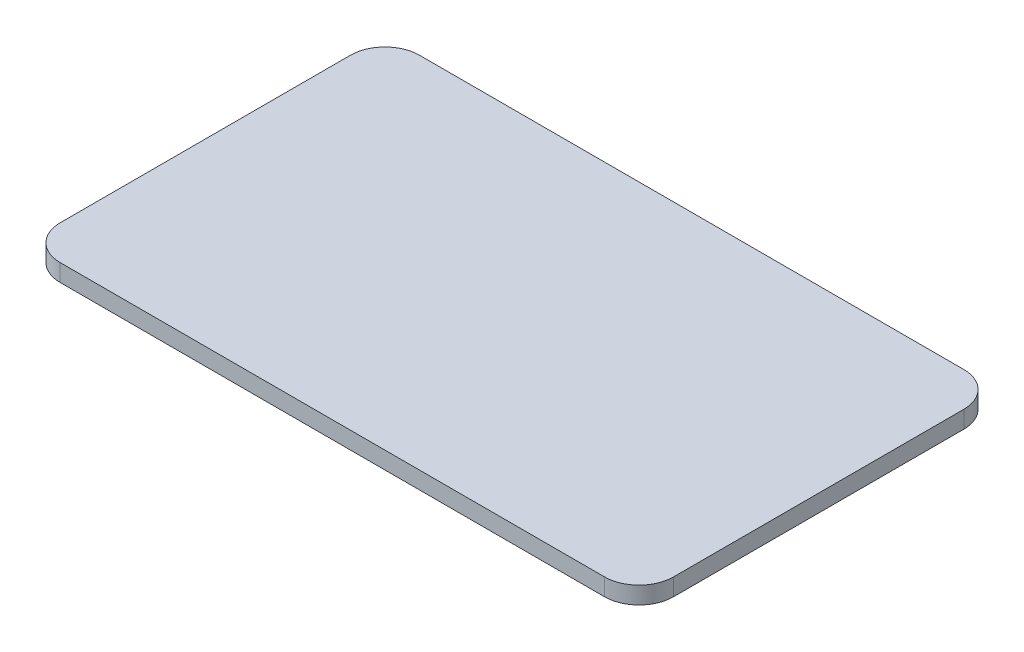
ISO-10303-21;
HEADER;
FILE_DESCRIPTION(('STEP AP214'),'2;1');
FILE_NAME('part.step','',(''),(''),'','','');
FILE_SCHEMA(('AUTOMOTIVE_DESIGN { 1 0 10303 214 1 1 1 1 }'));
ENDSEC;
DATA;
#1=APPLICATION_CONTEXT('core data for automotive mechanical design processes');
#2=APPLICATION_PROTOCOL_DEFINITION('international standard','automotive_design',2000,#1);
#3=PRODUCT_CONTEXT('',#1,'mechanical');
#4=PRODUCT('Part','Part','',(#3));
#5=PRODUCT_RELATED_PRODUCT_CATEGORY('part','',(#4));
#6=PRODUCT_DEFINITION_FORMATION('','',#4);
#7=PRODUCT_DEFINITION_CONTEXT('part definition',#1,'design');
#8=PRODUCT_DEFINITION('design','',#6,#7);
#9=PRODUCT_DEFINITION_SHAPE('','',#8);
#10=(LENGTH_UNIT() NAMED_UNIT(*) SI_UNIT(.MILLI.,.METRE.));
#11=(NAMED_UNIT(*) PLANE_ANGLE_UNIT() SI_UNIT($,.RADIAN.));
#12=(NAMED_UNIT(*) SI_UNIT($,.STERADIAN.) SOLID_ANGLE_UNIT());
#13=UNCERTAINTY_MEASURE_WITH_UNIT(LENGTH_MEASURE(1.E-05),#10,'distance_accuracy_value','');
#14=(GEOMETRIC_REPRESENTATION_CONTEXT(3) GLOBAL_UNCERTAINTY_ASSIGNED_CONTEXT((#13)) GLOBAL_UNIT_ASSIGNED_CONTEXT((#10,
#11,#12)) REPRESENTATION_CONTEXT('',''));
#15=CARTESIAN_POINT('',(0.,0.,0.));
#16=DIRECTION('',(0.,0.,1.));
#17=DIRECTION('',(1.,0.,0.));
#18=AXIS2_PLACEMENT_3D('',#15,#16,#17);
#19=CARTESIAN_POINT('',(39.45,2.5,21.035));
#20=DIRECTION('',(0.,-1.,0.));
#21=DIRECTION('',(0.,0.,-1.));
#22=AXIS2_PLACEMENT_3D('',#19,#20,#21);
#23=CYLINDRICAL_SURFACE('',#22,5.);
#24=CARTESIAN_POINT('',(39.45,0.,21.035));
#25=DIRECTION('',(0.,1.,0.));
#26=DIRECTION('',(0.,0.,1.));
#27=AXIS2_PLACEMENT_3D('',#24,#25,#26);
#28=CIRCLE('',#27,5.);
#29=CARTESIAN_POINT('',(39.45,0.,26.035));
#30=VERTEX_POINT('',#29);
#31=CARTESIAN_POINT('',(44.45,0.,21.035));
#32=VERTEX_POINT('',#31);
#33=EDGE_CURVE('E136',#30,#32,#28,.T.);
#34=ORIENTED_EDGE('',*,*,#33,.T.);
#35=DIRECTION('',(0.,-1.,0.));
#36=VECTOR('',#35,1.);
#37=CARTESIAN_POINT('',(44.45,2.5,21.035));
#38=LINE('',#37,#36);
#39=CARTESIAN_POINT('',(44.45,2.5,21.035));
#40=VERTEX_POINT('',#39);
#41=EDGE_CURVE('E11',#40,#32,#38,.T.);
#42=ORIENTED_EDGE('',*,*,#41,.F.);
#43=CARTESIAN_POINT('',(39.45,2.5,21.035));
#44=DIRECTION('',(0.,1.,0.));
#45=DIRECTION('',(0.,0.,1.));
#46=AXIS2_PLACEMENT_3D('',#43,#44,#45);
#47=CIRCLE('',#46,5.);
#48=CARTESIAN_POINT('',(39.45,2.5,26.035));
#49=VERTEX_POINT('',#48);
#50=EDGE_CURVE('E150',#49,#40,#47,.T.);
#51=ORIENTED_EDGE('',*,*,#50,.F.);
#52=DIRECTION('',(0.,-1.,0.));
#53=VECTOR('',#52,1.);
#54=CARTESIAN_POINT('',(39.45,2.5,26.035));
#55=LINE('',#54,#53);
#56=EDGE_CURVE('E132',#49,#30,#55,.T.);
#57=ORIENTED_EDGE('',*,*,#56,.T.);
#58=EDGE_LOOP('',(#34,#42,#51,#57));
#59=FACE_BOUND('',#58,.T.);
#60=ADVANCED_FACE('F40',(#59),#23,.T.);
#61=CARTESIAN_POINT('',(44.45,2.5,21.035));
#62=DIRECTION('',(-1.,0.,0.));
#63=DIRECTION('',(0.,0.,1.));
#64=AXIS2_PLACEMENT_3D('',#61,#62,#63);
#65=PLANE('',#64);
#66=DIRECTION('',(0.,0.,-1.));
#67=VECTOR('',#66,1.);
#68=CARTESIAN_POINT('',(44.45,0.,21.035));
#69=LINE('',#68,#67);
#70=CARTESIAN_POINT('',(44.45,0.,-21.035));
#71=VERTEX_POINT('',#70);
#72=EDGE_CURVE('E139',#32,#71,#69,.T.);
#73=ORIENTED_EDGE('',*,*,#72,.T.);
#74=DIRECTION('',(0.,-1.,0.));
#75=VECTOR('',#74,1.);
#76=CARTESIAN_POINT('',(44.45,2.5,-21.035));
#77=LINE('',#76,#75);
#78=CARTESIAN_POINT('',(44.45,2.5,-21.035));
#79=VERTEX_POINT('',#78);
#80=EDGE_CURVE('E48',#79,#71,#77,.T.);
#81=ORIENTED_EDGE('',*,*,#80,.F.);
#82=DIRECTION('',(0.,0.,-1.));
#83=VECTOR('',#82,1.);
#84=CARTESIAN_POINT('',(44.45,2.5,21.035));
#85=LINE('',#84,#83);
#86=EDGE_CURVE('E99',#40,#79,#85,.T.);
#87=ORIENTED_EDGE('',*,*,#86,.F.);
#88=ORIENTED_EDGE('',*,*,#41,.T.);
#89=EDGE_LOOP('',(#73,#81,#87,#88));
#90=FACE_BOUND('',#89,.T.);
#91=ADVANCED_FACE('F185',(#90),#65,.F.);
#92=CARTESIAN_POINT('',(39.45,2.5,-21.035));
#93=DIRECTION('',(0.,-1.,0.));
#94=DIRECTION('',(0.,0.,-1.));
#95=AXIS2_PLACEMENT_3D('',#92,#93,#94);
#96=CYLINDRICAL_SURFACE('',#95,5.);
#97=CARTESIAN_POINT('',(39.45,0.,-21.035));
#98=DIRECTION('',(0.,1.,0.));
#99=DIRECTION('',(0.,0.,-1.));
#100=AXIS2_PLACEMENT_3D('',#97,#98,#99);
#101=CIRCLE('',#100,5.);
#102=CARTESIAN_POINT('',(39.45,0.,-26.035));
#103=VERTEX_POINT('',#102);
#104=EDGE_CURVE('E141',#71,#103,#101,.T.);
#105=ORIENTED_EDGE('',*,*,#104,.T.);
#106=DIRECTION('',(0.,-1.,0.));
#107=VECTOR('',#106,1.);
#108=CARTESIAN_POINT('',(39.45,2.5,-26.035));
#109=LINE('',#108,#107);
#110=CARTESIAN_POINT('',(39.45,2.5,-26.035));
#111=VERTEX_POINT('',#110);
#112=EDGE_CURVE('E157',#111,#103,#109,.T.);
#113=ORIENTED_EDGE('',*,*,#112,.F.);
#114=CARTESIAN_POINT('',(39.45,2.5,-21.035));
#115=DIRECTION('',(0.,1.,0.));
#116=DIRECTION('',(0.,0.,-1.));
#117=AXIS2_PLACEMENT_3D('',#114,#115,#116);
#118=CIRCLE('',#117,5.);
#119=EDGE_CURVE('E165',#79,#111,#118,.T.);
#120=ORIENTED_EDGE('',*,*,#119,.F.);
#121=ORIENTED_EDGE('',*,*,#80,.T.);
#122=EDGE_LOOP('',(#105,#113,#120,#121));
#123=FACE_BOUND('',#122,.T.);
#124=ADVANCED_FACE('F163',(#123),#96,.T.);
#125=CARTESIAN_POINT('',(-39.45,2.5,-26.035));
#126=DIRECTION('',(0.,0.,1.));
#127=DIRECTION('',(1.,0.,0.));
#128=AXIS2_PLACEMENT_3D('',#125,#126,#127);
#129=PLANE('',#128);
#130=DIRECTION('',(-1.,0.,0.));
#131=VECTOR('',#130,1.);
#132=CARTESIAN_POINT('',(-39.45,0.,-26.035));
#133=LINE('',#132,#131);
#134=CARTESIAN_POINT('',(-39.45,0.,-26.035));
#135=VERTEX_POINT('',#134);
#136=EDGE_CURVE('E143',#103,#135,#133,.T.);
#137=ORIENTED_EDGE('',*,*,#136,.T.);
#138=DIRECTION('',(0.,-1.,0.));
#139=VECTOR('',#138,1.);
#140=CARTESIAN_POINT('',(-39.45,2.5,-26.035));
#141=LINE('',#140,#139);
#142=CARTESIAN_POINT('',(-39.45,2.5,-26.035));
#143=VERTEX_POINT('',#142);
#144=EDGE_CURVE('E154',#143,#135,#141,.T.);
#145=ORIENTED_EDGE('',*,*,#144,.F.);
#146=DIRECTION('',(-1.,0.,0.));
#147=VECTOR('',#146,1.);
#148=CARTESIAN_POINT('',(-39.45,2.5,-26.035));
#149=LINE('',#148,#147);
#150=EDGE_CURVE('E177',#111,#143,#149,.T.);
#151=ORIENTED_EDGE('',*,*,#150,.F.);
#152=ORIENTED_EDGE('',*,*,#112,.T.);
#153=EDGE_LOOP('',(#137,#145,#151,#152));
#154=FACE_BOUND('',#153,.T.);
#155=ADVANCED_FACE('F173',(#154),#129,.F.);
#156=CARTESIAN_POINT('',(-39.45,2.5,-21.035));
#157=DIRECTION('',(0.,-1.,0.));
#158=DIRECTION('',(0.,0.,-1.));
#159=AXIS2_PLACEMENT_3D('',#156,#157,#158);
#160=CYLINDRICAL_SURFACE('',#159,5.);
#161=CARTESIAN_POINT('',(-39.45,0.,-21.035));
#162=DIRECTION('',(0.,1.,0.));
#163=DIRECTION('',(0.,0.,-1.));
#164=AXIS2_PLACEMENT_3D('',#161,#162,#163);
#165=CIRCLE('',#164,5.);
#166=CARTESIAN_POINT('',(-44.45,0.,-21.035));
#167=VERTEX_POINT('',#166);
#168=EDGE_CURVE('E145',#135,#167,#165,.T.);
#169=ORIENTED_EDGE('',*,*,#168,.T.);
#170=DIRECTION('',(0.,-1.,0.));
#171=VECTOR('',#170,1.);
#172=CARTESIAN_POINT('',(-44.45,2.5,-21.035));
#173=LINE('',#172,#171);
#174=CARTESIAN_POINT('',(-44.45,2.5,-21.035));
#175=VERTEX_POINT('',#174);
#176=EDGE_CURVE('E127',#175,#167,#173,.T.);
#177=ORIENTED_EDGE('',*,*,#176,.F.);
#178=CARTESIAN_POINT('',(-39.45,2.5,-21.035));
#179=DIRECTION('',(0.,1.,0.));
#180=DIRECTION('',(0.,0.,-1.));
#181=AXIS2_PLACEMENT_3D('',#178,#179,#180);
#182=CIRCLE('',#181,5.);
#183=EDGE_CURVE('E118',#143,#175,#182,.T.);
#184=ORIENTED_EDGE('',*,*,#183,.F.);
#185=ORIENTED_EDGE('',*,*,#144,.T.);
#186=EDGE_LOOP('',(#169,#177,#184,#185));
#187=FACE_BOUND('',#186,.T.);
#188=ADVANCED_FACE('F176',(#187),#160,.T.);
#189=CARTESIAN_POINT('',(-44.45,2.5,21.035));
#190=DIRECTION('',(1.,0.,0.));
#191=DIRECTION('',(0.,0.,-1.));
#192=AXIS2_PLACEMENT_3D('',#189,#190,#191);
#193=PLANE('',#192);
#194=DIRECTION('',(0.,0.,1.));
#195=VECTOR('',#194,1.);
#196=CARTESIAN_POINT('',(-44.45,0.,21.035));
#197=LINE('',#196,#195);
#198=CARTESIAN_POINT('',(-44.45,0.,21.035));
#199=VERTEX_POINT('',#198);
#200=EDGE_CURVE('E126',#167,#199,#197,.T.);
#201=ORIENTED_EDGE('',*,*,#200,.T.);
#202=DIRECTION('',(0.,-1.,0.));
#203=VECTOR('',#202,1.);
#204=CARTESIAN_POINT('',(-44.45,2.5,21.035));
#205=LINE('',#204,#203);
#206=CARTESIAN_POINT('',(-44.45,2.5,21.035));
#207=VERTEX_POINT('',#206);
#208=EDGE_CURVE('E123',#207,#199,#205,.T.);
#209=ORIENTED_EDGE('',*,*,#208,.F.);
#210=DIRECTION('',(0.,0.,1.));
#211=VECTOR('',#210,1.);
#212=CARTESIAN_POINT('',(-44.45,2.5,21.035));
#213=LINE('',#212,#211);
#214=EDGE_CURVE('E112',#175,#207,#213,.T.);
#215=ORIENTED_EDGE('',*,*,#214,.F.);
#216=ORIENTED_EDGE('',*,*,#176,.T.);
#217=EDGE_LOOP('',(#201,#209,#215,#216));
#218=FACE_BOUND('',#217,.T.);
#219=ADVANCED_FACE('F124',(#218),#193,.F.);
#220=CARTESIAN_POINT('',(-39.45,2.5,21.035));
#221=DIRECTION('',(0.,-1.,0.));
#222=DIRECTION('',(0.,0.,-1.));
#223=AXIS2_PLACEMENT_3D('',#220,#221,#222);
#224=CYLINDRICAL_SURFACE('',#223,5.);
#225=CARTESIAN_POINT('',(-39.45,0.,21.035));
#226=DIRECTION('',(0.,1.,0.));
#227=DIRECTION('',(0.,0.,-1.));
#228=AXIS2_PLACEMENT_3D('',#225,#226,#227);
#229=CIRCLE('',#228,5.);
#230=CARTESIAN_POINT('',(-39.45,0.,26.035));
#231=VERTEX_POINT('',#230);
#232=EDGE_CURVE('E85',#199,#231,#229,.T.);
#233=ORIENTED_EDGE('',*,*,#232,.T.);
#234=DIRECTION('',(0.,-1.,0.));
#235=VECTOR('',#234,1.);
#236=CARTESIAN_POINT('',(-39.45,2.5,26.035));
#237=LINE('',#236,#235);
#238=CARTESIAN_POINT('',(-39.45,2.5,26.035));
#239=VERTEX_POINT('',#238);
#240=EDGE_CURVE('E128',#239,#231,#237,.T.);
#241=ORIENTED_EDGE('',*,*,#240,.F.);
#242=CARTESIAN_POINT('',(-39.45,2.5,21.035));
#243=DIRECTION('',(0.,1.,0.));
#244=DIRECTION('',(0.,0.,-1.));
#245=AXIS2_PLACEMENT_3D('',#242,#243,#244);
#246=CIRCLE('',#245,5.);
#247=EDGE_CURVE('E116',#207,#239,#246,.T.);
#248=ORIENTED_EDGE('',*,*,#247,.F.);
#249=ORIENTED_EDGE('',*,*,#208,.T.);
#250=EDGE_LOOP('',(#233,#241,#248,#249));
#251=FACE_BOUND('',#250,.T.);
#252=ADVANCED_FACE('F130',(#251),#224,.T.);
#253=CARTESIAN_POINT('',(-39.45,2.5,26.035));
#254=DIRECTION('',(0.,0.,-1.));
#255=DIRECTION('',(-1.,0.,0.));
#256=AXIS2_PLACEMENT_3D('',#253,#254,#255);
#257=PLANE('',#256);
#258=DIRECTION('',(1.,0.,0.));
#259=VECTOR('',#258,1.);
#260=CARTESIAN_POINT('',(-39.45,0.,26.035));
#261=LINE('',#260,#259);
#262=EDGE_CURVE('E91',#231,#30,#261,.T.);
#263=ORIENTED_EDGE('',*,*,#262,.T.);
#264=ORIENTED_EDGE('',*,*,#56,.F.);
#265=DIRECTION('',(1.,0.,0.));
#266=VECTOR('',#265,1.);
#267=CARTESIAN_POINT('',(-39.45,2.5,26.035));
#268=LINE('',#267,#266);
#269=EDGE_CURVE('E56',#239,#49,#268,.T.);
#270=ORIENTED_EDGE('',*,*,#269,.F.);
#271=ORIENTED_EDGE('',*,*,#240,.T.);
#272=EDGE_LOOP('',(#263,#264,#270,#271));
#273=FACE_BOUND('',#272,.T.);
#274=ADVANCED_FACE('F201',(#273),#257,.F.);
#275=CARTESIAN_POINT('',(39.45,2.5,21.035));
#276=DIRECTION('',(0.,1.,0.));
#277=DIRECTION('',(0.,0.,1.));
#278=AXIS2_PLACEMENT_3D('',#275,#276,#277);
#279=PLANE('',#278);
#280=ORIENTED_EDGE('',*,*,#50,.T.);
#281=ORIENTED_EDGE('',*,*,#86,.T.);
#282=ORIENTED_EDGE('',*,*,#119,.T.);
#283=ORIENTED_EDGE('',*,*,#150,.T.);
#284=ORIENTED_EDGE('',*,*,#183,.T.);
#285=ORIENTED_EDGE('',*,*,#214,.T.);
#286=ORIENTED_EDGE('',*,*,#247,.T.);
#287=ORIENTED_EDGE('',*,*,#269,.T.);
#288=EDGE_LOOP('',(#280,#281,#282,#283,#284,#285,#286,#287));
#289=FACE_BOUND('',#288,.T.);
#290=ADVANCED_FACE('F114',(#289),#279,.T.);
#291=CARTESIAN_POINT('',(39.45,0.,21.035));
#292=DIRECTION('',(0.,1.,0.));
#293=DIRECTION('',(0.,0.,1.));
#294=AXIS2_PLACEMENT_3D('',#291,#292,#293);
#295=PLANE('',#294);
#296=ORIENTED_EDGE('',*,*,#33,.F.);
#297=ORIENTED_EDGE('',*,*,#262,.F.);
#298=ORIENTED_EDGE('',*,*,#232,.F.);
#299=ORIENTED_EDGE('',*,*,#200,.F.);
#300=ORIENTED_EDGE('',*,*,#168,.F.);
#301=ORIENTED_EDGE('',*,*,#136,.F.);
#302=ORIENTED_EDGE('',*,*,#104,.F.);
#303=ORIENTED_EDGE('',*,*,#72,.F.);
#304=EDGE_LOOP('',(#296,#297,#298,#299,#300,#301,#302,#303));
#305=FACE_BOUND('',#304,.T.);
#306=ADVANCED_FACE('F169',(#305),#295,.F.);
#307=CLOSED_SHELL('',(#60,#91,#124,#155,#188,#219,#252,#274,#290,#306));
#308=MANIFOLD_SOLID_BREP('B2',#307);
#309=ADVANCED_BREP_SHAPE_REPRESENTATION('',(#18,#308),#14);
#310=SHAPE_DEFINITION_REPRESENTATION(#9,#309);
ENDSEC;
END-ISO-10303-21;
